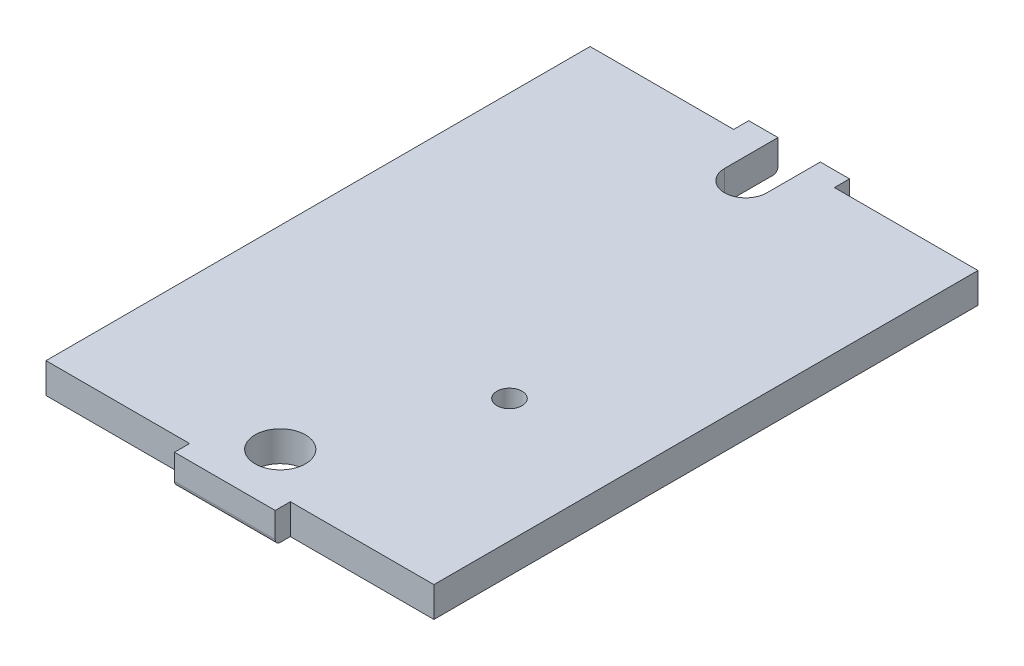
ISO-10303-21;
HEADER;
FILE_DESCRIPTION(('STEP AP214'),'2;1');
FILE_NAME('part.step','',(''),(''),'','','');
FILE_SCHEMA(('AUTOMOTIVE_DESIGN { 1 0 10303 214 1 1 1 1 }'));
ENDSEC;
DATA;
#1=APPLICATION_CONTEXT('core data for automotive mechanical design processes');
#2=APPLICATION_PROTOCOL_DEFINITION('international standard','automotive_design',2000,#1);
#3=PRODUCT_CONTEXT('',#1,'mechanical');
#4=PRODUCT('Part','Part','',(#3));
#5=PRODUCT_RELATED_PRODUCT_CATEGORY('part','',(#4));
#6=PRODUCT_DEFINITION_FORMATION('','',#4);
#7=PRODUCT_DEFINITION_CONTEXT('part definition',#1,'design');
#8=PRODUCT_DEFINITION('design','',#6,#7);
#9=PRODUCT_DEFINITION_SHAPE('','',#8);
#10=(LENGTH_UNIT() NAMED_UNIT(*) SI_UNIT(.MILLI.,.METRE.));
#11=(NAMED_UNIT(*) PLANE_ANGLE_UNIT() SI_UNIT($,.RADIAN.));
#12=(NAMED_UNIT(*) SI_UNIT($,.STERADIAN.) SOLID_ANGLE_UNIT());
#13=UNCERTAINTY_MEASURE_WITH_UNIT(LENGTH_MEASURE(1.E-05),#10,'distance_accuracy_value','');
#14=(GEOMETRIC_REPRESENTATION_CONTEXT(3) GLOBAL_UNCERTAINTY_ASSIGNED_CONTEXT((#13)) GLOBAL_UNIT_ASSIGNED_CONTEXT((#10,
#11,#12)) REPRESENTATION_CONTEXT('',''));
#15=CARTESIAN_POINT('',(0.,0.,0.));
#16=DIRECTION('',(0.,0.,1.));
#17=DIRECTION('',(1.,0.,0.));
#18=AXIS2_PLACEMENT_3D('',#15,#16,#17);
#19=CARTESIAN_POINT('',(-5.,3.,-28.5));
#20=DIRECTION('',(0.,0.,1.));
#21=DIRECTION('',(1.,0.,0.));
#22=AXIS2_PLACEMENT_3D('',#19,#20,#21);
#23=PLANE('',#22);
#24=DIRECTION('',(-1.,0.,0.));
#25=VECTOR('',#24,1.);
#26=CARTESIAN_POINT('',(-5.,3.,-28.5));
#27=LINE('',#26,#25);
#28=CARTESIAN_POINT('',(-2.1,3.,-28.5));
#29=VERTEX_POINT('',#28);
#30=CARTESIAN_POINT('',(-5.,3.,-28.5));
#31=VERTEX_POINT('',#30);
#32=EDGE_CURVE('E226',#29,#31,#27,.T.);
#33=ORIENTED_EDGE('',*,*,#32,.F.);
#34=DIRECTION('',(0.,1.,0.));
#35=VECTOR('',#34,1.);
#36=CARTESIAN_POINT('',(-2.1,0.,-28.5));
#37=LINE('',#36,#35);
#38=CARTESIAN_POINT('',(-2.1,0.5,-28.5));
#39=VERTEX_POINT('',#38);
#40=EDGE_CURVE('E205',#39,#29,#37,.T.);
#41=ORIENTED_EDGE('',*,*,#40,.F.);
#42=DIRECTION('',(-1.,0.,0.));
#43=VECTOR('',#42,1.);
#44=CARTESIAN_POINT('',(-5.,0.5,-28.5));
#45=LINE('',#44,#43);
#46=CARTESIAN_POINT('',(-5.,0.5,-28.5));
#47=VERTEX_POINT('',#46);
#48=EDGE_CURVE('E299',#39,#47,#45,.T.);
#49=ORIENTED_EDGE('',*,*,#48,.T.);
#50=DIRECTION('',(0.,-1.,0.));
#51=VECTOR('',#50,1.);
#52=CARTESIAN_POINT('',(-5.,3.,-28.5));
#53=LINE('',#52,#51);
#54=EDGE_CURVE('E284',#31,#47,#53,.T.);
#55=ORIENTED_EDGE('',*,*,#54,.F.);
#56=EDGE_LOOP('',(#33,#41,#49,#55));
#57=FACE_BOUND('',#56,.T.);
#58=ADVANCED_FACE('F36',(#57),#23,.F.);
#59=CARTESIAN_POINT('',(-5.,0.5,-28.));
#60=DIRECTION('',(1.,0.,0.));
#61=DIRECTION('',(0.,0.,-1.));
#62=AXIS2_PLACEMENT_3D('',#59,#60,#61);
#63=CYLINDRICAL_SURFACE('',#62,0.5);
#64=CARTESIAN_POINT('',(-2.1,0.5,-28.));
#65=DIRECTION('',(-1.,0.,0.));
#66=DIRECTION('',(0.,0.,1.));
#67=AXIS2_PLACEMENT_3D('',#64,#65,#66);
#68=CIRCLE('',#67,0.5);
#69=CARTESIAN_POINT('',(-2.1,0.,-28.));
#70=VERTEX_POINT('',#69);
#71=EDGE_CURVE('E319',#70,#39,#68,.F.);
#72=ORIENTED_EDGE('',*,*,#71,.F.);
#73=DIRECTION('',(-1.,0.,0.));
#74=VECTOR('',#73,1.);
#75=CARTESIAN_POINT('',(5.,0.,-28.));
#76=LINE('',#75,#74);
#77=CARTESIAN_POINT('',(-5.,0.,-28.));
#78=VERTEX_POINT('',#77);
#79=EDGE_CURVE('E194',#78,#70,#76,.F.);
#80=ORIENTED_EDGE('',*,*,#79,.F.);
#81=CARTESIAN_POINT('',(-5.,0.5,-28.));
#82=DIRECTION('',(1.,0.,0.));
#83=DIRECTION('',(0.,0.,-1.));
#84=AXIS2_PLACEMENT_3D('',#81,#82,#83);
#85=CIRCLE('',#84,0.5);
#86=EDGE_CURVE('E303',#47,#78,#85,.F.);
#87=ORIENTED_EDGE('',*,*,#86,.F.);
#88=ORIENTED_EDGE('',*,*,#48,.F.);
#89=EDGE_LOOP('',(#72,#80,#87,#88));
#90=FACE_BOUND('',#89,.T.);
#91=ADVANCED_FACE('F334',(#90),#63,.T.);
#92=CARTESIAN_POINT('',(5.,3.,27.));
#93=DIRECTION('',(0.,0.,-1.));
#94=DIRECTION('',(-1.,0.,0.));
#95=AXIS2_PLACEMENT_3D('',#92,#93,#94);
#96=PLANE('',#95);
#97=DIRECTION('',(1.,0.,0.));
#98=VECTOR('',#97,1.);
#99=CARTESIAN_POINT('',(5.,0.,27.));
#100=LINE('',#99,#98);
#101=CARTESIAN_POINT('',(5.,0.,27.));
#102=VERTEX_POINT('',#101);
#103=CARTESIAN_POINT('',(19.25,0.,27.));
#104=VERTEX_POINT('',#103);
#105=EDGE_CURVE('E213',#102,#104,#100,.T.);
#106=ORIENTED_EDGE('',*,*,#105,.T.);
#107=DIRECTION('',(0.,-1.,0.));
#108=VECTOR('',#107,1.);
#109=CARTESIAN_POINT('',(19.25,3.,27.));
#110=LINE('',#109,#108);
#111=CARTESIAN_POINT('',(19.25,3.,27.));
#112=VERTEX_POINT('',#111);
#113=EDGE_CURVE('E296',#112,#104,#110,.T.);
#114=ORIENTED_EDGE('',*,*,#113,.F.);
#115=DIRECTION('',(1.,0.,0.));
#116=VECTOR('',#115,1.);
#117=CARTESIAN_POINT('',(5.,3.,27.));
#118=LINE('',#117,#116);
#119=CARTESIAN_POINT('',(5.,3.,27.));
#120=VERTEX_POINT('',#119);
#121=EDGE_CURVE('E216',#120,#112,#118,.T.);
#122=ORIENTED_EDGE('',*,*,#121,.F.);
#123=DIRECTION('',(0.,-1.,0.));
#124=VECTOR('',#123,1.);
#125=CARTESIAN_POINT('',(5.,3.,27.));
#126=LINE('',#125,#124);
#127=EDGE_CURVE('E244',#120,#102,#126,.T.);
#128=ORIENTED_EDGE('',*,*,#127,.T.);
#129=EDGE_LOOP('',(#106,#114,#122,#128));
#130=FACE_BOUND('',#129,.T.);
#131=ADVANCED_FACE('F341',(#130),#96,.F.);
#132=CARTESIAN_POINT('',(19.25,3.,-27.));
#133=DIRECTION('',(-1.,0.,0.));
#134=DIRECTION('',(0.,0.,1.));
#135=AXIS2_PLACEMENT_3D('',#132,#133,#134);
#136=PLANE('',#135);
#137=DIRECTION('',(0.,0.,-1.));
#138=VECTOR('',#137,1.);
#139=CARTESIAN_POINT('',(19.25,0.,-27.));
#140=LINE('',#139,#138);
#141=CARTESIAN_POINT('',(19.25,0.,-27.));
#142=VERTEX_POINT('',#141);
#143=EDGE_CURVE('E247',#104,#142,#140,.T.);
#144=ORIENTED_EDGE('',*,*,#143,.T.);
#145=DIRECTION('',(0.,-1.,0.));
#146=VECTOR('',#145,1.);
#147=CARTESIAN_POINT('',(19.25,3.,-27.));
#148=LINE('',#147,#146);
#149=CARTESIAN_POINT('',(19.25,3.,-27.));
#150=VERTEX_POINT('',#149);
#151=EDGE_CURVE('E293',#150,#142,#148,.T.);
#152=ORIENTED_EDGE('',*,*,#151,.F.);
#153=DIRECTION('',(0.,0.,-1.));
#154=VECTOR('',#153,1.);
#155=CARTESIAN_POINT('',(19.25,3.,-27.));
#156=LINE('',#155,#154);
#157=EDGE_CURVE('E219',#112,#150,#156,.T.);
#158=ORIENTED_EDGE('',*,*,#157,.F.);
#159=ORIENTED_EDGE('',*,*,#113,.T.);
#160=EDGE_LOOP('',(#144,#152,#158,#159));
#161=FACE_BOUND('',#160,.T.);
#162=ADVANCED_FACE('F378',(#161),#136,.F.);
#163=CARTESIAN_POINT('',(5.,3.,-27.));
#164=DIRECTION('',(0.,0.,1.));
#165=DIRECTION('',(1.,0.,0.));
#166=AXIS2_PLACEMENT_3D('',#163,#164,#165);
#167=PLANE('',#166);
#168=DIRECTION('',(-1.,0.,0.));
#169=VECTOR('',#168,1.);
#170=CARTESIAN_POINT('',(5.,0.,-27.));
#171=LINE('',#170,#169);
#172=CARTESIAN_POINT('',(5.,0.,-27.));
#173=VERTEX_POINT('',#172);
#174=EDGE_CURVE('E249',#142,#173,#171,.T.);
#175=ORIENTED_EDGE('',*,*,#174,.T.);
#176=DIRECTION('',(0.,-1.,0.));
#177=VECTOR('',#176,1.);
#178=CARTESIAN_POINT('',(5.,3.,-27.));
#179=LINE('',#178,#177);
#180=CARTESIAN_POINT('',(5.,3.,-27.));
#181=VERTEX_POINT('',#180);
#182=EDGE_CURVE('E290',#181,#173,#179,.T.);
#183=ORIENTED_EDGE('',*,*,#182,.F.);
#184=DIRECTION('',(-1.,0.,0.));
#185=VECTOR('',#184,1.);
#186=CARTESIAN_POINT('',(5.,3.,-27.));
#187=LINE('',#186,#185);
#188=EDGE_CURVE('E222',#150,#181,#187,.T.);
#189=ORIENTED_EDGE('',*,*,#188,.F.);
#190=ORIENTED_EDGE('',*,*,#151,.T.);
#191=EDGE_LOOP('',(#175,#183,#189,#190));
#192=FACE_BOUND('',#191,.T.);
#193=ADVANCED_FACE('F358',(#192),#167,.F.);
#194=CARTESIAN_POINT('',(5.,3.,-27.));
#195=DIRECTION('',(-1.,0.,0.));
#196=DIRECTION('',(0.,0.,1.));
#197=AXIS2_PLACEMENT_3D('',#194,#195,#196);
#198=PLANE('',#197);
#199=DIRECTION('',(0.,0.,-1.));
#200=VECTOR('',#199,1.);
#201=CARTESIAN_POINT('',(5.,0.,-27.));
#202=LINE('',#201,#200);
#203=CARTESIAN_POINT('',(5.,0.,-28.));
#204=VERTEX_POINT('',#203);
#205=EDGE_CURVE('E251',#173,#204,#202,.T.);
#206=ORIENTED_EDGE('',*,*,#205,.T.);
#207=CARTESIAN_POINT('',(5.,0.5,-28.));
#208=DIRECTION('',(-1.,0.,0.));
#209=DIRECTION('',(0.,0.,1.));
#210=AXIS2_PLACEMENT_3D('',#207,#208,#209);
#211=CIRCLE('',#210,0.5);
#212=CARTESIAN_POINT('',(5.,0.5,-28.5));
#213=VERTEX_POINT('',#212);
#214=EDGE_CURVE('E309',#204,#213,#211,.F.);
#215=ORIENTED_EDGE('',*,*,#214,.T.);
#216=DIRECTION('',(0.,-1.,0.));
#217=VECTOR('',#216,1.);
#218=CARTESIAN_POINT('',(5.,3.,-28.5));
#219=LINE('',#218,#217);
#220=CARTESIAN_POINT('',(5.,3.,-28.5));
#221=VERTEX_POINT('',#220);
#222=EDGE_CURVE('E287',#221,#213,#219,.T.);
#223=ORIENTED_EDGE('',*,*,#222,.F.);
#224=DIRECTION('',(0.,0.,-1.));
#225=VECTOR('',#224,1.);
#226=CARTESIAN_POINT('',(5.,3.,-27.));
#227=LINE('',#226,#225);
#228=EDGE_CURVE('E224',#181,#221,#227,.T.);
#229=ORIENTED_EDGE('',*,*,#228,.F.);
#230=ORIENTED_EDGE('',*,*,#182,.T.);
#231=EDGE_LOOP('',(#206,#215,#223,#229,#230));
#232=FACE_BOUND('',#231,.T.);
#233=ADVANCED_FACE('F350',(#232),#198,.F.);
#234=CARTESIAN_POINT('',(2.1,0.5,-28.5));
#235=VERTEX_POINT('',#234);
#236=EDGE_CURVE('E300',#213,#235,#45,.T.);
#237=ORIENTED_EDGE('',*,*,#236,.T.);
#238=DIRECTION('',(0.,1.,0.));
#239=VECTOR('',#238,1.);
#240=CARTESIAN_POINT('',(2.1,0.,-28.5));
#241=LINE('',#240,#239);
#242=CARTESIAN_POINT('',(2.1,3.,-28.5));
#243=VERTEX_POINT('',#242);
#244=EDGE_CURVE('E51',#235,#243,#241,.T.);
#245=ORIENTED_EDGE('',*,*,#244,.T.);
#246=EDGE_CURVE('E227',#221,#243,#27,.T.);
#247=ORIENTED_EDGE('',*,*,#246,.F.);
#248=ORIENTED_EDGE('',*,*,#222,.T.);
#249=EDGE_LOOP('',(#237,#245,#247,#248));
#250=FACE_BOUND('',#249,.T.);
#251=ADVANCED_FACE('F337',(#250),#23,.F.);
#252=CARTESIAN_POINT('',(-5.,3.,-27.));
#253=DIRECTION('',(1.,0.,0.));
#254=DIRECTION('',(0.,0.,-1.));
#255=AXIS2_PLACEMENT_3D('',#252,#253,#254);
#256=PLANE('',#255);
#257=ORIENTED_EDGE('',*,*,#54,.T.);
#258=ORIENTED_EDGE('',*,*,#86,.T.);
#259=DIRECTION('',(0.,0.,1.));
#260=VECTOR('',#259,1.);
#261=CARTESIAN_POINT('',(-5.,0.,-27.));
#262=LINE('',#261,#260);
#263=CARTESIAN_POINT('',(-5.,0.,-27.));
#264=VERTEX_POINT('',#263);
#265=EDGE_CURVE('E254',#78,#264,#262,.T.);
#266=ORIENTED_EDGE('',*,*,#265,.T.);
#267=DIRECTION('',(0.,-1.,0.));
#268=VECTOR('',#267,1.);
#269=CARTESIAN_POINT('',(-5.,3.,-27.));
#270=LINE('',#269,#268);
#271=CARTESIAN_POINT('',(-5.,3.,-27.));
#272=VERTEX_POINT('',#271);
#273=EDGE_CURVE('E281',#272,#264,#270,.T.);
#274=ORIENTED_EDGE('',*,*,#273,.F.);
#275=DIRECTION('',(0.,0.,1.));
#276=VECTOR('',#275,1.);
#277=CARTESIAN_POINT('',(-5.,3.,-27.));
#278=LINE('',#277,#276);
#279=EDGE_CURVE('E230',#31,#272,#278,.T.);
#280=ORIENTED_EDGE('',*,*,#279,.F.);
#281=EDGE_LOOP('',(#257,#258,#266,#274,#280));
#282=FACE_BOUND('',#281,.T.);
#283=ADVANCED_FACE('F349',(#282),#256,.F.);
#284=CARTESIAN_POINT('',(-19.25,3.,-27.));
#285=DIRECTION('',(0.,0.,1.));
#286=DIRECTION('',(1.,0.,0.));
#287=AXIS2_PLACEMENT_3D('',#284,#285,#286);
#288=PLANE('',#287);
#289=DIRECTION('',(-1.,0.,0.));
#290=VECTOR('',#289,1.);
#291=CARTESIAN_POINT('',(-19.25,0.,-27.));
#292=LINE('',#291,#290);
#293=CARTESIAN_POINT('',(-19.25,0.,-27.));
#294=VERTEX_POINT('',#293);
#295=EDGE_CURVE('E256',#264,#294,#292,.T.);
#296=ORIENTED_EDGE('',*,*,#295,.T.);
#297=DIRECTION('',(0.,-1.,0.));
#298=VECTOR('',#297,1.);
#299=CARTESIAN_POINT('',(-19.25,3.,-27.));
#300=LINE('',#299,#298);
#301=CARTESIAN_POINT('',(-19.25,3.,-27.));
#302=VERTEX_POINT('',#301);
#303=EDGE_CURVE('E278',#302,#294,#300,.T.);
#304=ORIENTED_EDGE('',*,*,#303,.F.);
#305=DIRECTION('',(-1.,0.,0.));
#306=VECTOR('',#305,1.);
#307=CARTESIAN_POINT('',(-19.25,3.,-27.));
#308=LINE('',#307,#306);
#309=EDGE_CURVE('E232',#272,#302,#308,.T.);
#310=ORIENTED_EDGE('',*,*,#309,.F.);
#311=ORIENTED_EDGE('',*,*,#273,.T.);
#312=EDGE_LOOP('',(#296,#304,#310,#311));
#313=FACE_BOUND('',#312,.T.);
#314=ADVANCED_FACE('F356',(#313),#288,.F.);
#315=CARTESIAN_POINT('',(-19.25,3.,-27.));
#316=DIRECTION('',(1.,0.,0.));
#317=DIRECTION('',(0.,0.,-1.));
#318=AXIS2_PLACEMENT_3D('',#315,#316,#317);
#319=PLANE('',#318);
#320=DIRECTION('',(0.,0.,1.));
#321=VECTOR('',#320,1.);
#322=CARTESIAN_POINT('',(-19.25,0.,-27.));
#323=LINE('',#322,#321);
#324=CARTESIAN_POINT('',(-19.25,0.,27.));
#325=VERTEX_POINT('',#324);
#326=EDGE_CURVE('E258',#294,#325,#323,.T.);
#327=ORIENTED_EDGE('',*,*,#326,.T.);
#328=DIRECTION('',(0.,-1.,0.));
#329=VECTOR('',#328,1.);
#330=CARTESIAN_POINT('',(-19.25,3.,27.));
#331=LINE('',#330,#329);
#332=CARTESIAN_POINT('',(-19.25,3.,27.));
#333=VERTEX_POINT('',#332);
#334=EDGE_CURVE('E275',#333,#325,#331,.T.);
#335=ORIENTED_EDGE('',*,*,#334,.F.);
#336=DIRECTION('',(0.,0.,1.));
#337=VECTOR('',#336,1.);
#338=CARTESIAN_POINT('',(-19.25,3.,-27.));
#339=LINE('',#338,#337);
#340=EDGE_CURVE('E234',#302,#333,#339,.T.);
#341=ORIENTED_EDGE('',*,*,#340,.F.);
#342=ORIENTED_EDGE('',*,*,#303,.T.);
#343=EDGE_LOOP('',(#327,#335,#341,#342));
#344=FACE_BOUND('',#343,.T.);
#345=ADVANCED_FACE('F408',(#344),#319,.F.);
#346=CARTESIAN_POINT('',(-19.25,3.,27.));
#347=DIRECTION('',(0.,0.,-1.));
#348=DIRECTION('',(-1.,0.,0.));
#349=AXIS2_PLACEMENT_3D('',#346,#347,#348);
#350=PLANE('',#349);
#351=DIRECTION('',(1.,0.,0.));
#352=VECTOR('',#351,1.);
#353=CARTESIAN_POINT('',(-19.25,0.,27.));
#354=LINE('',#353,#352);
#355=CARTESIAN_POINT('',(-5.,0.,27.));
#356=VERTEX_POINT('',#355);
#357=EDGE_CURVE('E260',#325,#356,#354,.T.);
#358=ORIENTED_EDGE('',*,*,#357,.T.);
#359=DIRECTION('',(0.,-1.,0.));
#360=VECTOR('',#359,1.);
#361=CARTESIAN_POINT('',(-5.,3.,27.));
#362=LINE('',#361,#360);
#363=CARTESIAN_POINT('',(-5.,3.,27.));
#364=VERTEX_POINT('',#363);
#365=EDGE_CURVE('E272',#364,#356,#362,.T.);
#366=ORIENTED_EDGE('',*,*,#365,.F.);
#367=DIRECTION('',(1.,0.,0.));
#368=VECTOR('',#367,1.);
#369=CARTESIAN_POINT('',(-19.25,3.,27.));
#370=LINE('',#369,#368);
#371=EDGE_CURVE('E236',#333,#364,#370,.T.);
#372=ORIENTED_EDGE('',*,*,#371,.F.);
#373=ORIENTED_EDGE('',*,*,#334,.T.);
#374=EDGE_LOOP('',(#358,#366,#372,#373));
#375=FACE_BOUND('',#374,.T.);
#376=ADVANCED_FACE('F403',(#375),#350,.F.);
#377=CARTESIAN_POINT('',(-5.,3.,27.));
#378=DIRECTION('',(1.,0.,0.));
#379=DIRECTION('',(0.,0.,-1.));
#380=AXIS2_PLACEMENT_3D('',#377,#378,#379);
#381=PLANE('',#380);
#382=DIRECTION('',(0.,0.,1.));
#383=VECTOR('',#382,1.);
#384=CARTESIAN_POINT('',(-5.,0.,27.));
#385=LINE('',#384,#383);
#386=CARTESIAN_POINT('',(-5.,0.,28.));
#387=VERTEX_POINT('',#386);
#388=EDGE_CURVE('E262',#356,#387,#385,.T.);
#389=ORIENTED_EDGE('',*,*,#388,.T.);
#390=CARTESIAN_POINT('',(-5.,0.5,28.));
#391=DIRECTION('',(1.,0.,0.));
#392=DIRECTION('',(0.,0.,-1.));
#393=AXIS2_PLACEMENT_3D('',#390,#391,#392);
#394=CIRCLE('',#393,0.5);
#395=CARTESIAN_POINT('',(-5.,0.5,28.5));
#396=VERTEX_POINT('',#395);
#397=EDGE_CURVE('E59',#387,#396,#394,.F.);
#398=ORIENTED_EDGE('',*,*,#397,.T.);
#399=DIRECTION('',(0.,-1.,0.));
#400=VECTOR('',#399,1.);
#401=CARTESIAN_POINT('',(-5.,3.,28.5));
#402=LINE('',#401,#400);
#403=CARTESIAN_POINT('',(-5.,3.,28.5));
#404=VERTEX_POINT('',#403);
#405=EDGE_CURVE('E270',#404,#396,#402,.T.);
#406=ORIENTED_EDGE('',*,*,#405,.F.);
#407=DIRECTION('',(0.,0.,1.));
#408=VECTOR('',#407,1.);
#409=CARTESIAN_POINT('',(-5.,3.,27.));
#410=LINE('',#409,#408);
#411=EDGE_CURVE('E238',#364,#404,#410,.T.);
#412=ORIENTED_EDGE('',*,*,#411,.F.);
#413=ORIENTED_EDGE('',*,*,#365,.T.);
#414=EDGE_LOOP('',(#389,#398,#406,#412,#413));
#415=FACE_BOUND('',#414,.T.);
#416=ADVANCED_FACE('F395',(#415),#381,.F.);
#417=CARTESIAN_POINT('',(-5.,3.,28.5));
#418=DIRECTION('',(0.,0.,-1.));
#419=DIRECTION('',(-1.,0.,0.));
#420=AXIS2_PLACEMENT_3D('',#417,#418,#419);
#421=PLANE('',#420);
#422=ORIENTED_EDGE('',*,*,#405,.T.);
#423=DIRECTION('',(1.,0.,0.));
#424=VECTOR('',#423,1.);
#425=CARTESIAN_POINT('',(5.,0.5,28.5));
#426=LINE('',#425,#424);
#427=CARTESIAN_POINT('',(5.,0.5,28.5));
#428=VERTEX_POINT('',#427);
#429=EDGE_CURVE('E311',#396,#428,#426,.T.);
#430=ORIENTED_EDGE('',*,*,#429,.T.);
#431=DIRECTION('',(0.,-1.,0.));
#432=VECTOR('',#431,1.);
#433=CARTESIAN_POINT('',(5.,3.,28.5));
#434=LINE('',#433,#432);
#435=CARTESIAN_POINT('',(5.,3.,28.5));
#436=VERTEX_POINT('',#435);
#437=EDGE_CURVE('E267',#436,#428,#434,.T.);
#438=ORIENTED_EDGE('',*,*,#437,.F.);
#439=DIRECTION('',(1.,0.,0.));
#440=VECTOR('',#439,1.);
#441=CARTESIAN_POINT('',(-5.,3.,28.5));
#442=LINE('',#441,#440);
#443=EDGE_CURVE('E240',#404,#436,#442,.T.);
#444=ORIENTED_EDGE('',*,*,#443,.F.);
#445=EDGE_LOOP('',(#422,#430,#438,#444));
#446=FACE_BOUND('',#445,.T.);
#447=ADVANCED_FACE('F392',(#446),#421,.F.);
#448=CARTESIAN_POINT('',(5.,3.,27.));
#449=DIRECTION('',(-1.,0.,0.));
#450=DIRECTION('',(0.,0.,1.));
#451=AXIS2_PLACEMENT_3D('',#448,#449,#450);
#452=PLANE('',#451);
#453=ORIENTED_EDGE('',*,*,#437,.T.);
#454=CARTESIAN_POINT('',(5.,0.5,28.));
#455=DIRECTION('',(-1.,0.,0.));
#456=DIRECTION('',(0.,0.,1.));
#457=AXIS2_PLACEMENT_3D('',#454,#455,#456);
#458=CIRCLE('',#457,0.5);
#459=CARTESIAN_POINT('',(5.,0.,28.));
#460=VERTEX_POINT('',#459);
#461=EDGE_CURVE('E314',#428,#460,#458,.F.);
#462=ORIENTED_EDGE('',*,*,#461,.T.);
#463=DIRECTION('',(0.,0.,-1.));
#464=VECTOR('',#463,1.);
#465=CARTESIAN_POINT('',(5.,0.,27.));
#466=LINE('',#465,#464);
#467=EDGE_CURVE('E220',#460,#102,#466,.T.);
#468=ORIENTED_EDGE('',*,*,#467,.T.);
#469=ORIENTED_EDGE('',*,*,#127,.F.);
#470=DIRECTION('',(0.,0.,-1.));
#471=VECTOR('',#470,1.);
#472=CARTESIAN_POINT('',(5.,3.,27.));
#473=LINE('',#472,#471);
#474=EDGE_CURVE('E242',#436,#120,#473,.T.);
#475=ORIENTED_EDGE('',*,*,#474,.F.);
#476=EDGE_LOOP('',(#453,#462,#468,#469,#475));
#477=FACE_BOUND('',#476,.T.);
#478=ADVANCED_FACE('F384',(#477),#452,.F.);
#479=CARTESIAN_POINT('',(0.,3.,0.));
#480=DIRECTION('',(0.,-1.,0.));
#481=DIRECTION('',(0.,0.,-1.));
#482=AXIS2_PLACEMENT_3D('',#479,#480,#481);
#483=PLANE('',#482);
#484=CARTESIAN_POINT('',(7.,3.,7.25));
#485=DIRECTION('',(0.,1.,0.));
#486=DIRECTION('',(0.,0.,1.));
#487=AXIS2_PLACEMENT_3D('',#484,#485,#486);
#488=CIRCLE('',#487,1.25);
#489=CARTESIAN_POINT('',(7.,3.,8.5));
#490=VERTEX_POINT('',#489);
#491=EDGE_CURVE('E200',#490,#490,#488,.T.);
#492=ORIENTED_EDGE('',*,*,#491,.F.);
#493=EDGE_LOOP('',(#492));
#494=FACE_BOUND('',#493,.T.);
#495=CARTESIAN_POINT('',(0.,3.,23.));
#496=DIRECTION('',(0.,1.,0.));
#497=DIRECTION('',(0.,0.,1.));
#498=AXIS2_PLACEMENT_3D('',#495,#496,#497);
#499=CIRCLE('',#498,2.5);
#500=CARTESIAN_POINT('',(0.,3.,25.5));
#501=VERTEX_POINT('',#500);
#502=EDGE_CURVE('E207',#501,#501,#499,.T.);
#503=ORIENTED_EDGE('',*,*,#502,.F.);
#504=EDGE_LOOP('',(#503));
#505=FACE_BOUND('',#504,.T.);
#506=CARTESIAN_POINT('',(0.,3.,-23.2));
#507=DIRECTION('',(0.,1.,0.));
#508=DIRECTION('',(0.,0.,1.));
#509=AXIS2_PLACEMENT_3D('',#506,#507,#508);
#510=CIRCLE('',#509,2.1);
#511=CARTESIAN_POINT('',(-2.1,3.,-23.2));
#512=VERTEX_POINT('',#511);
#513=CARTESIAN_POINT('',(2.1,3.,-23.2));
#514=VERTEX_POINT('',#513);
#515=EDGE_CURVE('E197',#512,#514,#510,.T.);
#516=ORIENTED_EDGE('',*,*,#515,.F.);
#517=DIRECTION('',(0.,0.,1.));
#518=VECTOR('',#517,1.);
#519=CARTESIAN_POINT('',(-2.1,3.,-28.5));
#520=LINE('',#519,#518);
#521=EDGE_CURVE('E175',#29,#512,#520,.T.);
#522=ORIENTED_EDGE('',*,*,#521,.F.);
#523=ORIENTED_EDGE('',*,*,#32,.T.);
#524=ORIENTED_EDGE('',*,*,#279,.T.);
#525=ORIENTED_EDGE('',*,*,#309,.T.);
#526=ORIENTED_EDGE('',*,*,#340,.T.);
#527=ORIENTED_EDGE('',*,*,#371,.T.);
#528=ORIENTED_EDGE('',*,*,#411,.T.);
#529=ORIENTED_EDGE('',*,*,#443,.T.);
#530=ORIENTED_EDGE('',*,*,#474,.T.);
#531=ORIENTED_EDGE('',*,*,#121,.T.);
#532=ORIENTED_EDGE('',*,*,#157,.T.);
#533=ORIENTED_EDGE('',*,*,#188,.T.);
#534=ORIENTED_EDGE('',*,*,#228,.T.);
#535=ORIENTED_EDGE('',*,*,#246,.T.);
#536=DIRECTION('',(0.,0.,-1.));
#537=VECTOR('',#536,1.);
#538=CARTESIAN_POINT('',(2.1,3.,-28.5));
#539=LINE('',#538,#537);
#540=EDGE_CURVE('E195',#514,#243,#539,.T.);
#541=ORIENTED_EDGE('',*,*,#540,.F.);
#542=EDGE_LOOP('',(#516,#522,#523,#524,#525,#526,#527,#528,#529,#530,#531,#532,#533,#534,#535,#541));
#543=FACE_BOUND('',#542,.T.);
#544=ADVANCED_FACE('F398',(#494,#505,#543),#483,.F.);
#545=CARTESIAN_POINT('',(0.,0.,0.));
#546=DIRECTION('',(0.,-1.,0.));
#547=DIRECTION('',(0.,0.,-1.));
#548=AXIS2_PLACEMENT_3D('',#545,#546,#547);
#549=PLANE('',#548);
#550=CARTESIAN_POINT('',(7.,0.,7.25));
#551=DIRECTION('',(0.,-1.,0.));
#552=DIRECTION('',(0.,0.,-1.));
#553=AXIS2_PLACEMENT_3D('',#550,#551,#552);
#554=CIRCLE('',#553,1.75);
#555=CARTESIAN_POINT('',(7.,0.,5.5));
#556=VERTEX_POINT('',#555);
#557=EDGE_CURVE('E44',#556,#556,#554,.F.);
#558=ORIENTED_EDGE('',*,*,#557,.T.);
#559=EDGE_LOOP('',(#558));
#560=FACE_BOUND('',#559,.T.);
#561=DIRECTION('',(0.,0.,1.));
#562=VECTOR('',#561,1.);
#563=CARTESIAN_POINT('',(-2.1,0.,-28.5));
#564=LINE('',#563,#562);
#565=CARTESIAN_POINT('',(-2.1,0.,-23.2));
#566=VERTEX_POINT('',#565);
#567=EDGE_CURVE('E172',#70,#566,#564,.T.);
#568=ORIENTED_EDGE('',*,*,#567,.T.);
#569=CARTESIAN_POINT('',(0.,0.,-23.2));
#570=DIRECTION('',(0.,1.,0.));
#571=DIRECTION('',(0.,0.,1.));
#572=AXIS2_PLACEMENT_3D('',#569,#570,#571);
#573=CIRCLE('',#572,2.1);
#574=CARTESIAN_POINT('',(2.1,0.,-23.2));
#575=VERTEX_POINT('',#574);
#576=EDGE_CURVE('E183',#566,#575,#573,.T.);
#577=ORIENTED_EDGE('',*,*,#576,.T.);
#578=DIRECTION('',(0.,0.,-1.));
#579=VECTOR('',#578,1.);
#580=CARTESIAN_POINT('',(2.1,0.,-28.5));
#581=LINE('',#580,#579);
#582=CARTESIAN_POINT('',(2.1,0.,-28.));
#583=VERTEX_POINT('',#582);
#584=EDGE_CURVE('E180',#575,#583,#581,.T.);
#585=ORIENTED_EDGE('',*,*,#584,.T.);
#586=EDGE_CURVE('E307',#583,#204,#76,.F.);
#587=ORIENTED_EDGE('',*,*,#586,.T.);
#588=ORIENTED_EDGE('',*,*,#205,.F.);
#589=ORIENTED_EDGE('',*,*,#174,.F.);
#590=ORIENTED_EDGE('',*,*,#143,.F.);
#591=ORIENTED_EDGE('',*,*,#105,.F.);
#592=ORIENTED_EDGE('',*,*,#467,.F.);
#593=DIRECTION('',(1.,0.,0.));
#594=VECTOR('',#593,1.);
#595=CARTESIAN_POINT('',(-5.,0.,28.));
#596=LINE('',#595,#594);
#597=EDGE_CURVE('E305',#460,#387,#596,.F.);
#598=ORIENTED_EDGE('',*,*,#597,.T.);
#599=ORIENTED_EDGE('',*,*,#388,.F.);
#600=ORIENTED_EDGE('',*,*,#357,.F.);
#601=ORIENTED_EDGE('',*,*,#326,.F.);
#602=ORIENTED_EDGE('',*,*,#295,.F.);
#603=ORIENTED_EDGE('',*,*,#265,.F.);
#604=ORIENTED_EDGE('',*,*,#79,.T.);
#605=EDGE_LOOP('',(#568,#577,#585,#587,#588,#589,#590,#591,#592,#598,#599,#600,#601,#602,#603,#604));
#606=FACE_BOUND('',#605,.T.);
#607=CARTESIAN_POINT('',(0.,0.,23.));
#608=DIRECTION('',(0.,1.,0.));
#609=DIRECTION('',(0.,0.,1.));
#610=AXIS2_PLACEMENT_3D('',#607,#608,#609);
#611=CIRCLE('',#610,2.5);
#612=CARTESIAN_POINT('',(0.,0.,25.5));
#613=VERTEX_POINT('',#612);
#614=EDGE_CURVE('E210',#613,#613,#611,.T.);
#615=ORIENTED_EDGE('',*,*,#614,.T.);
#616=EDGE_LOOP('',(#615));
#617=FACE_BOUND('',#616,.T.);
#618=ADVANCED_FACE('F190',(#560,#606,#617),#549,.T.);
#619=CARTESIAN_POINT('',(2.1,0.5,-28.));
#620=DIRECTION('',(1.,0.,0.));
#621=DIRECTION('',(0.,0.,-1.));
#622=AXIS2_PLACEMENT_3D('',#619,#620,#621);
#623=CIRCLE('',#622,0.5);
#624=EDGE_CURVE('E317',#235,#583,#623,.F.);
#625=ORIENTED_EDGE('',*,*,#624,.F.);
#626=ORIENTED_EDGE('',*,*,#236,.F.);
#627=ORIENTED_EDGE('',*,*,#214,.F.);
#628=ORIENTED_EDGE('',*,*,#586,.F.);
#629=EDGE_LOOP('',(#625,#626,#627,#628));
#630=FACE_BOUND('',#629,.T.);
#631=ADVANCED_FACE('F344',(#630),#63,.T.);
#632=CARTESIAN_POINT('',(-5.,0.5,28.));
#633=DIRECTION('',(-1.,0.,0.));
#634=DIRECTION('',(0.,0.,1.));
#635=AXIS2_PLACEMENT_3D('',#632,#633,#634);
#636=CYLINDRICAL_SURFACE('',#635,0.5);
#637=ORIENTED_EDGE('',*,*,#397,.F.);
#638=ORIENTED_EDGE('',*,*,#597,.F.);
#639=ORIENTED_EDGE('',*,*,#461,.F.);
#640=ORIENTED_EDGE('',*,*,#429,.F.);
#641=EDGE_LOOP('',(#637,#638,#639,#640));
#642=FACE_BOUND('',#641,.T.);
#643=ADVANCED_FACE('F388',(#642),#636,.T.);
#644=CARTESIAN_POINT('',(0.,0.,23.));
#645=DIRECTION('',(0.,1.,0.));
#646=DIRECTION('',(0.,0.,1.));
#647=AXIS2_PLACEMENT_3D('',#644,#645,#646);
#648=CYLINDRICAL_SURFACE('',#647,2.5);
#649=ORIENTED_EDGE('',*,*,#614,.F.);
#650=EDGE_LOOP('',(#649));
#651=FACE_BOUND('',#650,.T.);
#652=ORIENTED_EDGE('',*,*,#502,.T.);
#653=EDGE_LOOP('',(#652));
#654=FACE_BOUND('',#653,.T.);
#655=ADVANCED_FACE('F439',(#651,#654),#648,.F.);
#656=CARTESIAN_POINT('',(-2.1,0.,-28.5));
#657=DIRECTION('',(-1.,0.,0.));
#658=DIRECTION('',(0.,0.,1.));
#659=AXIS2_PLACEMENT_3D('',#656,#657,#658);
#660=PLANE('',#659);
#661=ORIENTED_EDGE('',*,*,#71,.T.);
#662=ORIENTED_EDGE('',*,*,#40,.T.);
#663=ORIENTED_EDGE('',*,*,#521,.T.);
#664=DIRECTION('',(0.,1.,0.));
#665=VECTOR('',#664,1.);
#666=CARTESIAN_POINT('',(-2.1,0.,-23.2));
#667=LINE('',#666,#665);
#668=EDGE_CURVE('E168',#566,#512,#667,.T.);
#669=ORIENTED_EDGE('',*,*,#668,.F.);
#670=ORIENTED_EDGE('',*,*,#567,.F.);
#671=EDGE_LOOP('',(#661,#662,#663,#669,#670));
#672=FACE_BOUND('',#671,.T.);
#673=ADVANCED_FACE('F170',(#672),#660,.F.);
#674=CARTESIAN_POINT('',(2.1,0.,-28.5));
#675=DIRECTION('',(1.,0.,0.));
#676=DIRECTION('',(0.,0.,-1.));
#677=AXIS2_PLACEMENT_3D('',#674,#675,#676);
#678=PLANE('',#677);
#679=ORIENTED_EDGE('',*,*,#624,.T.);
#680=ORIENTED_EDGE('',*,*,#584,.F.);
#681=DIRECTION('',(0.,1.,0.));
#682=VECTOR('',#681,1.);
#683=CARTESIAN_POINT('',(2.1,0.,-23.2));
#684=LINE('',#683,#682);
#685=EDGE_CURVE('E179',#575,#514,#684,.T.);
#686=ORIENTED_EDGE('',*,*,#685,.T.);
#687=ORIENTED_EDGE('',*,*,#540,.T.);
#688=ORIENTED_EDGE('',*,*,#244,.F.);
#689=EDGE_LOOP('',(#679,#680,#686,#687,#688));
#690=FACE_BOUND('',#689,.T.);
#691=ADVANCED_FACE('F366',(#690),#678,.F.);
#692=CARTESIAN_POINT('',(0.,0.,-23.2));
#693=DIRECTION('',(0.,1.,0.));
#694=DIRECTION('',(0.,0.,1.));
#695=AXIS2_PLACEMENT_3D('',#692,#693,#694);
#696=CYLINDRICAL_SURFACE('',#695,2.1);
#697=ORIENTED_EDGE('',*,*,#515,.T.);
#698=ORIENTED_EDGE('',*,*,#685,.F.);
#699=ORIENTED_EDGE('',*,*,#576,.F.);
#700=ORIENTED_EDGE('',*,*,#668,.T.);
#701=EDGE_LOOP('',(#697,#698,#699,#700));
#702=FACE_BOUND('',#701,.T.);
#703=ADVANCED_FACE('F184',(#702),#696,.F.);
#704=CARTESIAN_POINT('',(7.,0.,7.25));
#705=DIRECTION('',(0.,1.,0.));
#706=DIRECTION('',(0.,0.,1.));
#707=AXIS2_PLACEMENT_3D('',#704,#705,#706);
#708=CYLINDRICAL_SURFACE('',#707,1.25);
#709=CARTESIAN_POINT('',(7.,0.499999999999996,7.25));
#710=DIRECTION('',(0.,-1.,0.));
#711=DIRECTION('',(0.,0.,-1.));
#712=AXIS2_PLACEMENT_3D('',#709,#710,#711);
#713=CIRCLE('',#712,1.25);
#714=CARTESIAN_POINT('',(7.,0.499999999999996,6.));
#715=VERTEX_POINT('',#714);
#716=EDGE_CURVE('E11',#715,#715,#713,.T.);
#717=ORIENTED_EDGE('',*,*,#716,.T.);
#718=EDGE_LOOP('',(#717));
#719=FACE_BOUND('',#718,.T.);
#720=ORIENTED_EDGE('',*,*,#491,.T.);
#721=EDGE_LOOP('',(#720));
#722=FACE_BOUND('',#721,.T.);
#723=ADVANCED_FACE('F325',(#719,#722),#708,.F.);
#724=CARTESIAN_POINT('',(7.,0.,7.25));
#725=DIRECTION('',(0.,-1.,0.));
#726=DIRECTION('',(0.,0.,-1.));
#727=AXIS2_PLACEMENT_3D('',#724,#725,#726);
#728=CONICAL_SURFACE('',#727,1.75,0.785398163397453);
#729=ORIENTED_EDGE('',*,*,#716,.F.);
#730=EDGE_LOOP('',(#729));
#731=FACE_BOUND('',#730,.T.);
#732=ORIENTED_EDGE('',*,*,#557,.F.);
#733=EDGE_LOOP('',(#732));
#734=FACE_BOUND('',#733,.T.);
#735=ADVANCED_FACE('F38',(#731,#734),#728,.F.);
#736=CLOSED_SHELL('',(#58,#91,#131,#162,#193,#233,#251,#283,#314,#345,#376,#416,#447,#478,#544,
#618,#631,#643,#655,#673,#691,#703,#723,#735));
#737=MANIFOLD_SOLID_BREP('B2',#736);
#738=ADVANCED_BREP_SHAPE_REPRESENTATION('',(#18,#737),#14);
#739=SHAPE_DEFINITION_REPRESENTATION(#9,#738);
ENDSEC;
END-ISO-10303-21;
